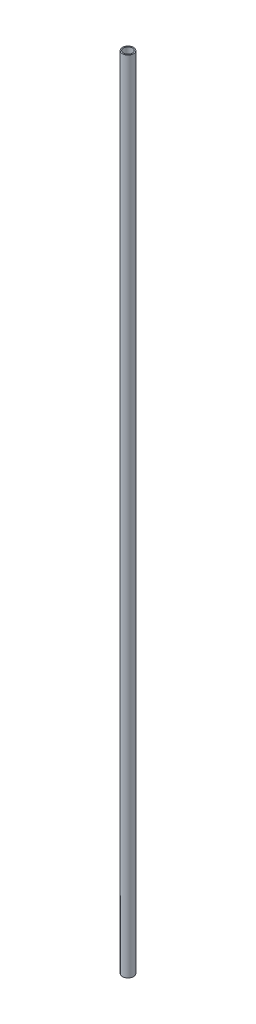
ISO-10303-21;
HEADER;
FILE_DESCRIPTION(('STEP AP214'),'2;1');
FILE_NAME('part.step','',(''),(''),'','','');
FILE_SCHEMA(('AUTOMOTIVE_DESIGN { 1 0 10303 214 1 1 1 1 }'));
ENDSEC;
DATA;
#1=APPLICATION_CONTEXT('core data for automotive mechanical design processes');
#2=APPLICATION_PROTOCOL_DEFINITION('international standard','automotive_design',2000,#1);
#3=PRODUCT_CONTEXT('',#1,'mechanical');
#4=PRODUCT('Part','Part','',(#3));
#5=PRODUCT_RELATED_PRODUCT_CATEGORY('part','',(#4));
#6=PRODUCT_DEFINITION_FORMATION('','',#4);
#7=PRODUCT_DEFINITION_CONTEXT('part definition',#1,'design');
#8=PRODUCT_DEFINITION('design','',#6,#7);
#9=PRODUCT_DEFINITION_SHAPE('','',#8);
#10=(LENGTH_UNIT() NAMED_UNIT(*) SI_UNIT(.MILLI.,.METRE.));
#11=(NAMED_UNIT(*) PLANE_ANGLE_UNIT() SI_UNIT($,.RADIAN.));
#12=(NAMED_UNIT(*) SI_UNIT($,.STERADIAN.) SOLID_ANGLE_UNIT());
#13=UNCERTAINTY_MEASURE_WITH_UNIT(LENGTH_MEASURE(1.E-05),#10,'distance_accuracy_value','');
#14=(GEOMETRIC_REPRESENTATION_CONTEXT(3) GLOBAL_UNCERTAINTY_ASSIGNED_CONTEXT((#13)) GLOBAL_UNIT_ASSIGNED_CONTEXT((#10,
#11,#12)) REPRESENTATION_CONTEXT('',''));
#15=CARTESIAN_POINT('',(0.,0.,0.));
#16=DIRECTION('',(0.,0.,1.));
#17=DIRECTION('',(1.,0.,0.));
#18=AXIS2_PLACEMENT_3D('',#15,#16,#17);
#19=CARTESIAN_POINT('',(0.,-457.2,0.));
#20=DIRECTION('',(0.,1.,0.));
#21=DIRECTION('',(0.,0.,1.));
#22=AXIS2_PLACEMENT_3D('',#19,#20,#21);
#23=CYLINDRICAL_SURFACE('',#22,6.35);
#24=CARTESIAN_POINT('',(0.,-457.2,0.));
#25=DIRECTION('',(0.,1.,0.));
#26=DIRECTION('',(0.,0.,1.));
#27=AXIS2_PLACEMENT_3D('',#24,#25,#26);
#28=CIRCLE('',#27,6.35);
#29=CARTESIAN_POINT('',(0.,-457.2,6.35));
#30=VERTEX_POINT('',#29);
#31=EDGE_CURVE('E10',#30,#30,#28,.T.);
#32=ORIENTED_EDGE('',*,*,#31,.T.);
#33=EDGE_LOOP('',(#32));
#34=FACE_BOUND('',#33,.T.);
#35=CARTESIAN_POINT('',(0.,457.2,0.));
#36=DIRECTION('',(0.,1.,0.));
#37=DIRECTION('',(0.,0.,1.));
#38=AXIS2_PLACEMENT_3D('',#35,#36,#37);
#39=CIRCLE('',#38,6.35);
#40=CARTESIAN_POINT('',(0.,457.2,6.35));
#41=VERTEX_POINT('',#40);
#42=EDGE_CURVE('E41',#41,#41,#39,.T.);
#43=ORIENTED_EDGE('',*,*,#42,.F.);
#44=EDGE_LOOP('',(#43));
#45=FACE_BOUND('',#44,.T.);
#46=ADVANCED_FACE('F31',(#34,#45),#23,.T.);
#47=CARTESIAN_POINT('',(0.,-457.2,0.));
#48=DIRECTION('',(0.,1.,0.));
#49=DIRECTION('',(0.,0.,1.));
#50=AXIS2_PLACEMENT_3D('',#47,#48,#49);
#51=PLANE('',#50);
#52=CARTESIAN_POINT('',(0.,-457.2,0.));
#53=DIRECTION('',(0.,1.,0.));
#54=DIRECTION('',(0.,0.,1.));
#55=AXIS2_PLACEMENT_3D('',#52,#53,#54);
#56=CIRCLE('',#55,5.08);
#57=CARTESIAN_POINT('',(0.,-457.2,5.08));
#58=VERTEX_POINT('',#57);
#59=EDGE_CURVE('E37',#58,#58,#56,.T.);
#60=ORIENTED_EDGE('',*,*,#59,.T.);
#61=EDGE_LOOP('',(#60));
#62=FACE_BOUND('',#61,.T.);
#63=ORIENTED_EDGE('',*,*,#31,.F.);
#64=EDGE_LOOP('',(#63));
#65=FACE_BOUND('',#64,.T.);
#66=ADVANCED_FACE('F60',(#62,#65),#51,.F.);
#67=CARTESIAN_POINT('',(0.,-457.2,0.));
#68=DIRECTION('',(0.,1.,0.));
#69=DIRECTION('',(0.,0.,1.));
#70=AXIS2_PLACEMENT_3D('',#67,#68,#69);
#71=CYLINDRICAL_SURFACE('',#70,5.08);
#72=ORIENTED_EDGE('',*,*,#59,.F.);
#73=EDGE_LOOP('',(#72));
#74=FACE_BOUND('',#73,.T.);
#75=CARTESIAN_POINT('',(0.,457.2,0.));
#76=DIRECTION('',(0.,1.,0.));
#77=DIRECTION('',(0.,0.,1.));
#78=AXIS2_PLACEMENT_3D('',#75,#76,#77);
#79=CIRCLE('',#78,5.08);
#80=CARTESIAN_POINT('',(0.,457.2,5.08));
#81=VERTEX_POINT('',#80);
#82=EDGE_CURVE('E45',#81,#81,#79,.T.);
#83=ORIENTED_EDGE('',*,*,#82,.T.);
#84=EDGE_LOOP('',(#83));
#85=FACE_BOUND('',#84,.T.);
#86=ADVANCED_FACE('F51',(#74,#85),#71,.F.);
#87=CARTESIAN_POINT('',(0.,457.2,0.));
#88=DIRECTION('',(0.,1.,0.));
#89=DIRECTION('',(0.,0.,1.));
#90=AXIS2_PLACEMENT_3D('',#87,#88,#89);
#91=PLANE('',#90);
#92=ORIENTED_EDGE('',*,*,#42,.T.);
#93=EDGE_LOOP('',(#92));
#94=FACE_BOUND('',#93,.T.);
#95=ORIENTED_EDGE('',*,*,#82,.F.);
#96=EDGE_LOOP('',(#95));
#97=FACE_BOUND('',#96,.T.);
#98=ADVANCED_FACE('F53',(#94,#97),#91,.T.);
#99=CLOSED_SHELL('',(#46,#66,#86,#98));
#100=MANIFOLD_SOLID_BREP('B2',#99);
#101=ADVANCED_BREP_SHAPE_REPRESENTATION('',(#18,#100),#14);
#102=SHAPE_DEFINITION_REPRESENTATION(#9,#101);
ENDSEC;
END-ISO-10303-21;
